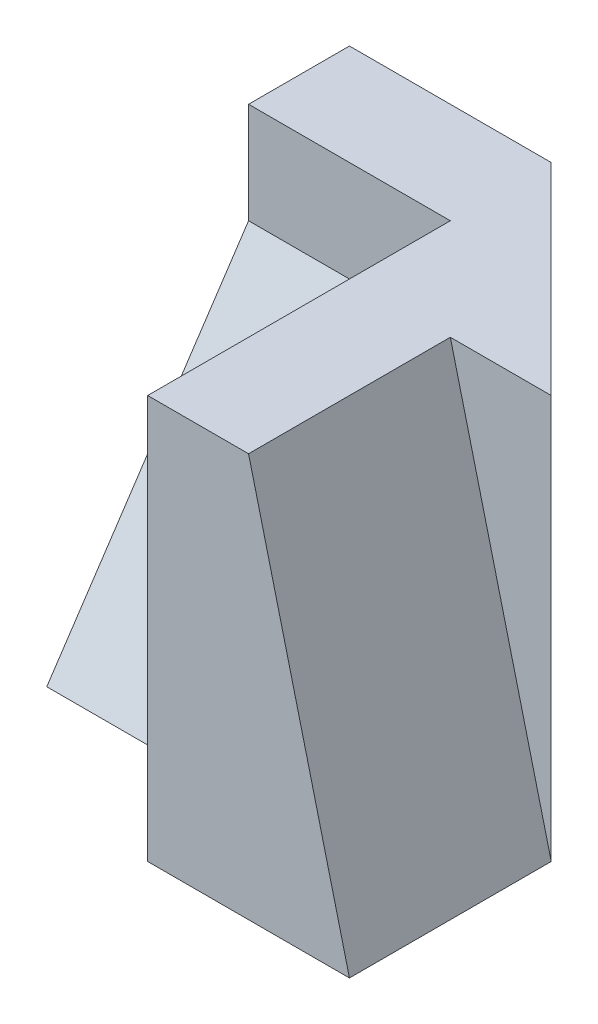
ISO-10303-21;
HEADER;
FILE_DESCRIPTION(('STEP AP214'),'2;1');
FILE_NAME('part.step','',(''),(''),'','','');
FILE_SCHEMA(('AUTOMOTIVE_DESIGN { 1 0 10303 214 1 1 1 1 }'));
ENDSEC;
DATA;
#1=APPLICATION_CONTEXT('core data for automotive mechanical design processes');
#2=APPLICATION_PROTOCOL_DEFINITION('international standard','automotive_design',2000,#1);
#3=PRODUCT_CONTEXT('',#1,'mechanical');
#4=PRODUCT('Part','Part','',(#3));
#5=PRODUCT_RELATED_PRODUCT_CATEGORY('part','',(#4));
#6=PRODUCT_DEFINITION_FORMATION('','',#4);
#7=PRODUCT_DEFINITION_CONTEXT('part definition',#1,'design');
#8=PRODUCT_DEFINITION('design','',#6,#7);
#9=PRODUCT_DEFINITION_SHAPE('','',#8);
#10=(LENGTH_UNIT() NAMED_UNIT(*) SI_UNIT(.MILLI.,.METRE.));
#11=(NAMED_UNIT(*) PLANE_ANGLE_UNIT() SI_UNIT($,.RADIAN.));
#12=(NAMED_UNIT(*) SI_UNIT($,.STERADIAN.) SOLID_ANGLE_UNIT());
#13=UNCERTAINTY_MEASURE_WITH_UNIT(LENGTH_MEASURE(1.E-05),#10,'distance_accuracy_value','');
#14=(GEOMETRIC_REPRESENTATION_CONTEXT(3) GLOBAL_UNCERTAINTY_ASSIGNED_CONTEXT((#13)) GLOBAL_UNIT_ASSIGNED_CONTEXT((#10,
#11,#12)) REPRESENTATION_CONTEXT('',''));
#15=CARTESIAN_POINT('',(0.,0.,0.));
#16=DIRECTION('',(0.,0.,1.));
#17=DIRECTION('',(1.,0.,0.));
#18=AXIS2_PLACEMENT_3D('',#15,#16,#17);
#19=CARTESIAN_POINT('',(0.,4.,-1.));
#20=DIRECTION('',(1.,0.,0.));
#21=DIRECTION('',(0.,0.,-1.));
#22=AXIS2_PLACEMENT_3D('',#19,#20,#21);
#23=PLANE('',#22);
#24=DIRECTION('',(0.,0.,1.));
#25=VECTOR('',#24,1.);
#26=CARTESIAN_POINT('',(0.,0.,-1.));
#27=LINE('',#26,#25);
#28=CARTESIAN_POINT('',(0.,0.,-1.));
#29=VERTEX_POINT('',#28);
#30=CARTESIAN_POINT('',(0.,0.,0.));
#31=VERTEX_POINT('',#30);
#32=EDGE_CURVE('E145',#29,#31,#27,.T.);
#33=ORIENTED_EDGE('',*,*,#32,.T.);
#34=DIRECTION('',(0.,-1.,0.));
#35=VECTOR('',#34,1.);
#36=CARTESIAN_POINT('',(0.,4.,0.));
#37=LINE('',#36,#35);
#38=CARTESIAN_POINT('',(0.,4.,0.));
#39=VERTEX_POINT('',#38);
#40=EDGE_CURVE('E11',#39,#31,#37,.T.);
#41=ORIENTED_EDGE('',*,*,#40,.F.);
#42=DIRECTION('',(0.,0.,1.));
#43=VECTOR('',#42,1.);
#44=CARTESIAN_POINT('',(0.,4.,-1.));
#45=LINE('',#44,#43);
#46=CARTESIAN_POINT('',(0.,4.,-3.));
#47=VERTEX_POINT('',#46);
#48=EDGE_CURVE('E111',#47,#39,#45,.T.);
#49=ORIENTED_EDGE('',*,*,#48,.F.);
#50=DIRECTION('',(0.,-1.,0.));
#51=VECTOR('',#50,1.);
#52=CARTESIAN_POINT('',(0.,4.,-3.));
#53=LINE('',#52,#51);
#54=CARTESIAN_POINT('',(0.,3.,-3.));
#55=VERTEX_POINT('',#54);
#56=EDGE_CURVE('E115',#47,#55,#53,.T.);
#57=ORIENTED_EDGE('',*,*,#56,.T.);
#58=DIRECTION('',(0.,-0.832050294337843,0.554700196225229));
#59=VECTOR('',#58,1.);
#60=CARTESIAN_POINT('',(0.,3.,-3.));
#61=LINE('',#60,#59);
#62=EDGE_CURVE('E126',#55,#29,#61,.T.);
#63=ORIENTED_EDGE('',*,*,#62,.T.);
#64=EDGE_LOOP('',(#33,#41,#49,#57,#63));
#65=FACE_BOUND('',#64,.T.);
#66=ADVANCED_FACE('F33',(#65),#23,.F.);
#67=CARTESIAN_POINT('',(0.,4.,0.));
#68=DIRECTION('',(0.,0.,-1.));
#69=DIRECTION('',(-1.,0.,0.));
#70=AXIS2_PLACEMENT_3D('',#67,#68,#69);
#71=PLANE('',#70);
#72=DIRECTION('',(1.,0.,0.));
#73=VECTOR('',#72,1.);
#74=CARTESIAN_POINT('',(0.,0.,0.));
#75=LINE('',#74,#73);
#76=CARTESIAN_POINT('',(2.,0.,0.));
#77=VERTEX_POINT('',#76);
#78=EDGE_CURVE('E154',#31,#77,#75,.T.);
#79=ORIENTED_EDGE('',*,*,#78,.T.);
#80=DIRECTION('',(0.242535625036333,-0.970142500145332,0.));
#81=VECTOR('',#80,1.);
#82=CARTESIAN_POINT('',(1.,4.,0.));
#83=LINE('',#82,#81);
#84=CARTESIAN_POINT('',(1.,4.,0.));
#85=VERTEX_POINT('',#84);
#86=EDGE_CURVE('E132',#85,#77,#83,.T.);
#87=ORIENTED_EDGE('',*,*,#86,.F.);
#88=DIRECTION('',(1.,0.,0.));
#89=VECTOR('',#88,1.);
#90=CARTESIAN_POINT('',(0.,4.,0.));
#91=LINE('',#90,#89);
#92=EDGE_CURVE('E82',#39,#85,#91,.T.);
#93=ORIENTED_EDGE('',*,*,#92,.F.);
#94=ORIENTED_EDGE('',*,*,#40,.T.);
#95=EDGE_LOOP('',(#79,#87,#93,#94));
#96=FACE_BOUND('',#95,.T.);
#97=ADVANCED_FACE('F191',(#96),#71,.F.);
#98=CARTESIAN_POINT('',(2.,4.,-2.));
#99=DIRECTION('',(-0.707106781186547,0.,0.707106781186548));
#100=DIRECTION('',(0.707106781186548,0.,0.707106781186547));
#101=AXIS2_PLACEMENT_3D('',#98,#99,#100);
#102=PLANE('',#101);
#103=DIRECTION('',(-0.707106781186548,0.,-0.707106781186547));
#104=VECTOR('',#103,1.);
#105=CARTESIAN_POINT('',(2.,0.,-2.));
#106=LINE('',#105,#104);
#107=CARTESIAN_POINT('',(2.,0.,-2.));
#108=VERTEX_POINT('',#107);
#109=CARTESIAN_POINT('',(0.,0.,-4.));
#110=VERTEX_POINT('',#109);
#111=EDGE_CURVE('E159',#108,#110,#106,.T.);
#112=ORIENTED_EDGE('',*,*,#111,.T.);
#113=DIRECTION('',(0.,-1.,0.));
#114=VECTOR('',#113,1.);
#115=CARTESIAN_POINT('',(0.,4.,-4.));
#116=LINE('',#115,#114);
#117=CARTESIAN_POINT('',(0.,4.,-4.));
#118=VERTEX_POINT('',#117);
#119=EDGE_CURVE('E166',#118,#110,#116,.T.);
#120=ORIENTED_EDGE('',*,*,#119,.F.);
#121=DIRECTION('',(-0.707106781186548,0.,-0.707106781186547));
#122=VECTOR('',#121,1.);
#123=CARTESIAN_POINT('',(2.,4.,-2.));
#124=LINE('',#123,#122);
#125=CARTESIAN_POINT('',(2.,4.,-2.));
#126=VERTEX_POINT('',#125);
#127=EDGE_CURVE('E148',#126,#118,#124,.T.);
#128=ORIENTED_EDGE('',*,*,#127,.F.);
#129=DIRECTION('',(0.,-1.,0.));
#130=VECTOR('',#129,1.);
#131=CARTESIAN_POINT('',(2.,4.,-2.));
#132=LINE('',#131,#130);
#133=EDGE_CURVE('E41',#126,#108,#132,.T.);
#134=ORIENTED_EDGE('',*,*,#133,.T.);
#135=EDGE_LOOP('',(#112,#120,#128,#134));
#136=FACE_BOUND('',#135,.T.);
#137=ADVANCED_FACE('F171',(#136),#102,.F.);
#138=CARTESIAN_POINT('',(0.,4.,-4.));
#139=DIRECTION('',(0.,0.,1.));
#140=DIRECTION('',(1.,0.,0.));
#141=AXIS2_PLACEMENT_3D('',#138,#139,#140);
#142=PLANE('',#141);
#143=DIRECTION('',(-1.,0.,0.));
#144=VECTOR('',#143,1.);
#145=CARTESIAN_POINT('',(0.,0.,-4.));
#146=LINE('',#145,#144);
#147=CARTESIAN_POINT('',(-2.,0.,-4.));
#148=VERTEX_POINT('',#147);
#149=EDGE_CURVE('E69',#110,#148,#146,.T.);
#150=ORIENTED_EDGE('',*,*,#149,.T.);
#151=DIRECTION('',(0.,-1.,0.));
#152=VECTOR('',#151,1.);
#153=CARTESIAN_POINT('',(-2.,4.,-4.));
#154=LINE('',#153,#152);
#155=CARTESIAN_POINT('',(-2.,4.,-4.));
#156=VERTEX_POINT('',#155);
#157=EDGE_CURVE('E152',#156,#148,#154,.T.);
#158=ORIENTED_EDGE('',*,*,#157,.F.);
#159=DIRECTION('',(-1.,0.,0.));
#160=VECTOR('',#159,1.);
#161=CARTESIAN_POINT('',(0.,4.,-4.));
#162=LINE('',#161,#160);
#163=EDGE_CURVE('E49',#118,#156,#162,.T.);
#164=ORIENTED_EDGE('',*,*,#163,.F.);
#165=ORIENTED_EDGE('',*,*,#119,.T.);
#166=EDGE_LOOP('',(#150,#158,#164,#165));
#167=FACE_BOUND('',#166,.T.);
#168=ADVANCED_FACE('F183',(#167),#142,.F.);
#169=CARTESIAN_POINT('',(-2.,4.,-4.));
#170=DIRECTION('',(1.,0.,0.));
#171=DIRECTION('',(0.,0.,-1.));
#172=AXIS2_PLACEMENT_3D('',#169,#170,#171);
#173=PLANE('',#172);
#174=DIRECTION('',(0.,0.,1.));
#175=VECTOR('',#174,1.);
#176=CARTESIAN_POINT('',(-2.,0.,-4.));
#177=LINE('',#176,#175);
#178=CARTESIAN_POINT('',(-2.,0.,-1.));
#179=VERTEX_POINT('',#178);
#180=EDGE_CURVE('E162',#148,#179,#177,.T.);
#181=ORIENTED_EDGE('',*,*,#180,.T.);
#182=DIRECTION('',(0.,-0.832050294337843,0.554700196225229));
#183=VECTOR('',#182,1.);
#184=CARTESIAN_POINT('',(-2.,3.,-3.));
#185=LINE('',#184,#183);
#186=CARTESIAN_POINT('',(-2.,3.,-3.));
#187=VERTEX_POINT('',#186);
#188=EDGE_CURVE('E76',#187,#179,#185,.T.);
#189=ORIENTED_EDGE('',*,*,#188,.F.);
#190=DIRECTION('',(0.,-1.,0.));
#191=VECTOR('',#190,1.);
#192=CARTESIAN_POINT('',(-2.,4.,-3.));
#193=LINE('',#192,#191);
#194=CARTESIAN_POINT('',(-2.,4.,-3.));
#195=VERTEX_POINT('',#194);
#196=EDGE_CURVE('E200',#195,#187,#193,.T.);
#197=ORIENTED_EDGE('',*,*,#196,.F.);
#198=DIRECTION('',(0.,0.,1.));
#199=VECTOR('',#198,1.);
#200=CARTESIAN_POINT('',(-2.,4.,-4.));
#201=LINE('',#200,#199);
#202=EDGE_CURVE('E130',#156,#195,#201,.T.);
#203=ORIENTED_EDGE('',*,*,#202,.F.);
#204=ORIENTED_EDGE('',*,*,#157,.T.);
#205=EDGE_LOOP('',(#181,#189,#197,#203,#204));
#206=FACE_BOUND('',#205,.T.);
#207=ADVANCED_FACE('F182',(#206),#173,.F.);
#208=CARTESIAN_POINT('',(0.,4.,0.));
#209=DIRECTION('',(0.,1.,0.));
#210=DIRECTION('',(0.,0.,1.));
#211=AXIS2_PLACEMENT_3D('',#208,#209,#210);
#212=PLANE('',#211);
#213=DIRECTION('',(-1.,0.,0.));
#214=VECTOR('',#213,1.);
#215=CARTESIAN_POINT('',(0.,4.,-3.));
#216=LINE('',#215,#214);
#217=EDGE_CURVE('E123',#47,#195,#216,.T.);
#218=ORIENTED_EDGE('',*,*,#217,.F.);
#219=ORIENTED_EDGE('',*,*,#48,.T.);
#220=ORIENTED_EDGE('',*,*,#92,.T.);
#221=DIRECTION('',(0.,0.,1.));
#222=VECTOR('',#221,1.);
#223=CARTESIAN_POINT('',(1.,4.,-2.));
#224=LINE('',#223,#222);
#225=CARTESIAN_POINT('',(1.,4.,-2.));
#226=VERTEX_POINT('',#225);
#227=EDGE_CURVE('E143',#226,#85,#224,.T.);
#228=ORIENTED_EDGE('',*,*,#227,.F.);
#229=DIRECTION('',(-1.,0.,0.));
#230=VECTOR('',#229,1.);
#231=CARTESIAN_POINT('',(2.,4.,-2.));
#232=LINE('',#231,#230);
#233=EDGE_CURVE('E137',#126,#226,#232,.T.);
#234=ORIENTED_EDGE('',*,*,#233,.F.);
#235=ORIENTED_EDGE('',*,*,#127,.T.);
#236=ORIENTED_EDGE('',*,*,#163,.T.);
#237=ORIENTED_EDGE('',*,*,#202,.T.);
#238=EDGE_LOOP('',(#218,#219,#220,#228,#234,#235,#236,#237));
#239=FACE_BOUND('',#238,.T.);
#240=ADVANCED_FACE('F128',(#239),#212,.T.);
#241=CARTESIAN_POINT('',(0.,0.,0.));
#242=DIRECTION('',(0.,1.,0.));
#243=DIRECTION('',(0.,0.,1.));
#244=AXIS2_PLACEMENT_3D('',#241,#242,#243);
#245=PLANE('',#244);
#246=ORIENTED_EDGE('',*,*,#32,.F.);
#247=DIRECTION('',(1.,0.,0.));
#248=VECTOR('',#247,1.);
#249=CARTESIAN_POINT('',(-2.,0.,-1.));
#250=LINE('',#249,#248);
#251=EDGE_CURVE('E118',#179,#29,#250,.T.);
#252=ORIENTED_EDGE('',*,*,#251,.F.);
#253=ORIENTED_EDGE('',*,*,#180,.F.);
#254=ORIENTED_EDGE('',*,*,#149,.F.);
#255=ORIENTED_EDGE('',*,*,#111,.F.);
#256=DIRECTION('',(0.,0.,-1.));
#257=VECTOR('',#256,1.);
#258=CARTESIAN_POINT('',(2.,0.,0.));
#259=LINE('',#258,#257);
#260=EDGE_CURVE('E157',#77,#108,#259,.T.);
#261=ORIENTED_EDGE('',*,*,#260,.F.);
#262=ORIENTED_EDGE('',*,*,#78,.F.);
#263=EDGE_LOOP('',(#246,#252,#253,#254,#255,#261,#262));
#264=FACE_BOUND('',#263,.T.);
#265=ADVANCED_FACE('F178',(#264),#245,.F.);
#266=CARTESIAN_POINT('',(1.,4.,-2.));
#267=DIRECTION('',(-0.970142500145332,-0.242535625036333,0.));
#268=DIRECTION('',(0.242535625036333,-0.970142500145332,0.));
#269=AXIS2_PLACEMENT_3D('',#266,#267,#268);
#270=PLANE('',#269);
#271=ORIENTED_EDGE('',*,*,#86,.T.);
#272=ORIENTED_EDGE('',*,*,#260,.T.);
#273=DIRECTION('',(0.242535625036333,-0.970142500145332,0.));
#274=VECTOR('',#273,1.);
#275=CARTESIAN_POINT('',(1.,4.,-2.));
#276=LINE('',#275,#274);
#277=EDGE_CURVE('E140',#226,#108,#276,.T.);
#278=ORIENTED_EDGE('',*,*,#277,.F.);
#279=ORIENTED_EDGE('',*,*,#227,.T.);
#280=EDGE_LOOP('',(#271,#272,#278,#279));
#281=FACE_BOUND('',#280,.T.);
#282=ADVANCED_FACE('F210',(#281),#270,.F.);
#283=CARTESIAN_POINT('',(0.,0.,-2.));
#284=DIRECTION('',(0.,0.,-1.));
#285=DIRECTION('',(-1.,0.,0.));
#286=AXIS2_PLACEMENT_3D('',#283,#284,#285);
#287=PLANE('',#286);
#288=ORIENTED_EDGE('',*,*,#233,.T.);
#289=ORIENTED_EDGE('',*,*,#277,.T.);
#290=ORIENTED_EDGE('',*,*,#133,.F.);
#291=EDGE_LOOP('',(#288,#289,#290));
#292=FACE_BOUND('',#291,.T.);
#293=ADVANCED_FACE('F203',(#292),#287,.F.);
#294=CARTESIAN_POINT('',(0.,3.,-3.));
#295=DIRECTION('',(0.,-0.554700196225229,-0.832050294337844));
#296=DIRECTION('',(0.,0.832050294337844,-0.554700196225229));
#297=AXIS2_PLACEMENT_3D('',#294,#295,#296);
#298=PLANE('',#297);
#299=ORIENTED_EDGE('',*,*,#188,.T.);
#300=ORIENTED_EDGE('',*,*,#251,.T.);
#301=ORIENTED_EDGE('',*,*,#62,.F.);
#302=DIRECTION('',(-1.,0.,0.));
#303=VECTOR('',#302,1.);
#304=CARTESIAN_POINT('',(0.,3.,-3.));
#305=LINE('',#304,#303);
#306=EDGE_CURVE('E125',#55,#187,#305,.T.);
#307=ORIENTED_EDGE('',*,*,#306,.T.);
#308=EDGE_LOOP('',(#299,#300,#301,#307));
#309=FACE_BOUND('',#308,.T.);
#310=ADVANCED_FACE('F199',(#309),#298,.F.);
#311=CARTESIAN_POINT('',(0.,4.,-3.));
#312=DIRECTION('',(0.,0.,-1.));
#313=DIRECTION('',(-1.,0.,0.));
#314=AXIS2_PLACEMENT_3D('',#311,#312,#313);
#315=PLANE('',#314);
#316=ORIENTED_EDGE('',*,*,#196,.T.);
#317=ORIENTED_EDGE('',*,*,#306,.F.);
#318=ORIENTED_EDGE('',*,*,#56,.F.);
#319=ORIENTED_EDGE('',*,*,#217,.T.);
#320=EDGE_LOOP('',(#316,#317,#318,#319));
#321=FACE_BOUND('',#320,.T.);
#322=ADVANCED_FACE('F122',(#321),#315,.F.);
#323=CLOSED_SHELL('',(#66,#97,#137,#168,#207,#240,#265,#282,#293,#310,#322));
#324=MANIFOLD_SOLID_BREP('B2',#323);
#325=ADVANCED_BREP_SHAPE_REPRESENTATION('',(#18,#324),#14);
#326=SHAPE_DEFINITION_REPRESENTATION(#9,#325);
ENDSEC;
END-ISO-10303-21;
